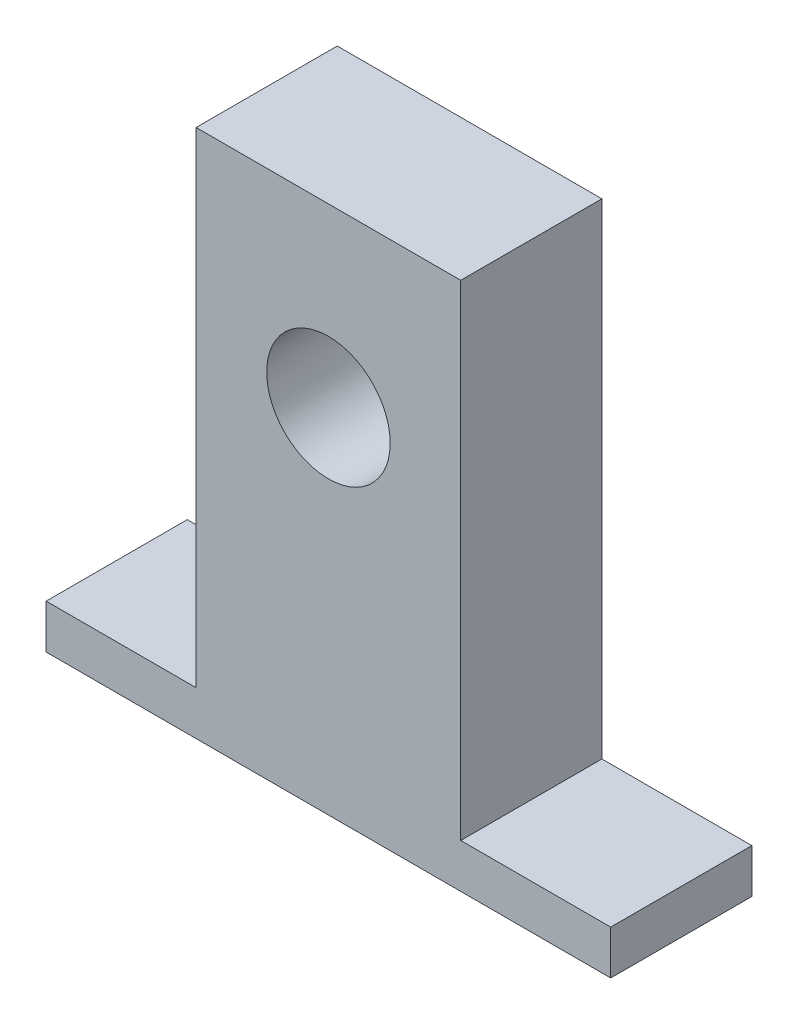
ISO-10303-21;
HEADER;
FILE_DESCRIPTION(('STEP AP214'),'2;1');
FILE_NAME('part.step','',(''),(''),'','','');
FILE_SCHEMA(('AUTOMOTIVE_DESIGN { 1 0 10303 214 1 1 1 1 }'));
ENDSEC;
DATA;
#1=APPLICATION_CONTEXT('core data for automotive mechanical design processes');
#2=APPLICATION_PROTOCOL_DEFINITION('international standard','automotive_design',2000,#1);
#3=PRODUCT_CONTEXT('',#1,'mechanical');
#4=PRODUCT('Part','Part','',(#3));
#5=PRODUCT_RELATED_PRODUCT_CATEGORY('part','',(#4));
#6=PRODUCT_DEFINITION_FORMATION('','',#4);
#7=PRODUCT_DEFINITION_CONTEXT('part definition',#1,'design');
#8=PRODUCT_DEFINITION('design','',#6,#7);
#9=PRODUCT_DEFINITION_SHAPE('','',#8);
#10=(LENGTH_UNIT() NAMED_UNIT(*) SI_UNIT(.MILLI.,.METRE.));
#11=(NAMED_UNIT(*) PLANE_ANGLE_UNIT() SI_UNIT($,.RADIAN.));
#12=(NAMED_UNIT(*) SI_UNIT($,.STERADIAN.) SOLID_ANGLE_UNIT());
#13=UNCERTAINTY_MEASURE_WITH_UNIT(LENGTH_MEASURE(1.E-05),#10,'distance_accuracy_value','');
#14=(GEOMETRIC_REPRESENTATION_CONTEXT(3) GLOBAL_UNCERTAINTY_ASSIGNED_CONTEXT((#13)) GLOBAL_UNIT_ASSIGNED_CONTEXT((#10,
#11,#12)) REPRESENTATION_CONTEXT('',''));
#15=CARTESIAN_POINT('',(0.,0.,0.));
#16=DIRECTION('',(0.,0.,1.));
#17=DIRECTION('',(1.,0.,0.));
#18=AXIS2_PLACEMENT_3D('',#15,#16,#17);
#19=CARTESIAN_POINT('',(0.,5.,0.));
#20=DIRECTION('',(0.,-1.,0.));
#21=DIRECTION('',(0.,0.,-1.));
#22=AXIS2_PLACEMENT_3D('',#19,#20,#21);
#23=PLANE('',#22);
#24=DIRECTION('',(0.,0.,-1.));
#25=VECTOR('',#24,1.);
#26=CARTESIAN_POINT('',(15.,5.,8.));
#27=LINE('',#26,#25);
#28=CARTESIAN_POINT('',(15.,5.,8.));
#29=VERTEX_POINT('',#28);
#30=CARTESIAN_POINT('',(15.,5.,-8.));
#31=VERTEX_POINT('',#30);
#32=EDGE_CURVE('E48',#29,#31,#27,.T.);
#33=ORIENTED_EDGE('',*,*,#32,.F.);
#34=DIRECTION('',(1.,0.,0.));
#35=VECTOR('',#34,1.);
#36=CARTESIAN_POINT('',(-32.,5.,8.));
#37=LINE('',#36,#35);
#38=CARTESIAN_POINT('',(32.,5.,8.));
#39=VERTEX_POINT('',#38);
#40=EDGE_CURVE('E137',#29,#39,#37,.T.);
#41=ORIENTED_EDGE('',*,*,#40,.T.);
#42=DIRECTION('',(0.,0.,-1.));
#43=VECTOR('',#42,1.);
#44=CARTESIAN_POINT('',(32.,5.,8.));
#45=LINE('',#44,#43);
#46=CARTESIAN_POINT('',(32.,5.,-8.));
#47=VERTEX_POINT('',#46);
#48=EDGE_CURVE('E128',#39,#47,#45,.T.);
#49=ORIENTED_EDGE('',*,*,#48,.T.);
#50=DIRECTION('',(-1.,0.,0.));
#51=VECTOR('',#50,1.);
#52=CARTESIAN_POINT('',(-32.,5.,-8.));
#53=LINE('',#52,#51);
#54=EDGE_CURVE('E133',#47,#31,#53,.T.);
#55=ORIENTED_EDGE('',*,*,#54,.T.);
#56=EDGE_LOOP('',(#33,#41,#49,#55));
#57=FACE_BOUND('',#56,.T.);
#58=ADVANCED_FACE('F33',(#57),#23,.F.);
#59=DIRECTION('',(0.,0.,1.));
#60=VECTOR('',#59,1.);
#61=CARTESIAN_POINT('',(-15.,5.,8.));
#62=LINE('',#61,#60);
#63=CARTESIAN_POINT('',(-15.,5.,-8.));
#64=VERTEX_POINT('',#63);
#65=CARTESIAN_POINT('',(-15.,5.,8.));
#66=VERTEX_POINT('',#65);
#67=EDGE_CURVE('E56',#64,#66,#62,.T.);
#68=ORIENTED_EDGE('',*,*,#67,.F.);
#69=CARTESIAN_POINT('',(-32.,5.,-8.));
#70=VERTEX_POINT('',#69);
#71=EDGE_CURVE('E131',#64,#70,#53,.T.);
#72=ORIENTED_EDGE('',*,*,#71,.T.);
#73=DIRECTION('',(0.,0.,1.));
#74=VECTOR('',#73,1.);
#75=CARTESIAN_POINT('',(-32.,5.,8.));
#76=LINE('',#75,#74);
#77=CARTESIAN_POINT('',(-32.,5.,8.));
#78=VERTEX_POINT('',#77);
#79=EDGE_CURVE('E135',#70,#78,#76,.T.);
#80=ORIENTED_EDGE('',*,*,#79,.T.);
#81=EDGE_CURVE('E138',#78,#66,#37,.T.);
#82=ORIENTED_EDGE('',*,*,#81,.T.);
#83=EDGE_LOOP('',(#68,#72,#80,#82));
#84=FACE_BOUND('',#83,.T.);
#85=ADVANCED_FACE('F194',(#84),#23,.F.);
#86=CARTESIAN_POINT('',(32.,5.,8.));
#87=DIRECTION('',(-1.,0.,0.));
#88=DIRECTION('',(0.,0.,1.));
#89=AXIS2_PLACEMENT_3D('',#86,#87,#88);
#90=PLANE('',#89);
#91=DIRECTION('',(0.,0.,-1.));
#92=VECTOR('',#91,1.);
#93=CARTESIAN_POINT('',(32.,0.,8.));
#94=LINE('',#93,#92);
#95=CARTESIAN_POINT('',(32.,0.,8.));
#96=VERTEX_POINT('',#95);
#97=CARTESIAN_POINT('',(32.,0.,-8.));
#98=VERTEX_POINT('',#97);
#99=EDGE_CURVE('E119',#96,#98,#94,.T.);
#100=ORIENTED_EDGE('',*,*,#99,.T.);
#101=DIRECTION('',(0.,-1.,0.));
#102=VECTOR('',#101,1.);
#103=CARTESIAN_POINT('',(32.,5.,-8.));
#104=LINE('',#103,#102);
#105=EDGE_CURVE('E11',#47,#98,#104,.T.);
#106=ORIENTED_EDGE('',*,*,#105,.F.);
#107=ORIENTED_EDGE('',*,*,#48,.F.);
#108=DIRECTION('',(0.,-1.,0.));
#109=VECTOR('',#108,1.);
#110=CARTESIAN_POINT('',(32.,5.,8.));
#111=LINE('',#110,#109);
#112=EDGE_CURVE('E139',#39,#96,#111,.T.);
#113=ORIENTED_EDGE('',*,*,#112,.T.);
#114=EDGE_LOOP('',(#100,#106,#107,#113));
#115=FACE_BOUND('',#114,.T.);
#116=ADVANCED_FACE('F35',(#115),#90,.F.);
#117=CARTESIAN_POINT('',(-32.,5.,-8.));
#118=DIRECTION('',(0.,0.,1.));
#119=DIRECTION('',(1.,0.,0.));
#120=AXIS2_PLACEMENT_3D('',#117,#118,#119);
#121=PLANE('',#120);
#122=CARTESIAN_POINT('',(0.,40.,-8.));
#123=DIRECTION('',(0.,0.,1.));
#124=DIRECTION('',(1.,0.,0.));
#125=AXIS2_PLACEMENT_3D('',#122,#123,#124);
#126=CIRCLE('',#125,7.);
#127=CARTESIAN_POINT('',(6.99999999999997,40.,-8.));
#128=VERTEX_POINT('',#127);
#129=EDGE_CURVE('E173',#128,#128,#126,.T.);
#130=ORIENTED_EDGE('',*,*,#129,.T.);
#131=EDGE_LOOP('',(#130));
#132=FACE_BOUND('',#131,.T.);
#133=DIRECTION('',(-1.,0.,0.));
#134=VECTOR('',#133,1.);
#135=CARTESIAN_POINT('',(-32.,0.,-8.));
#136=LINE('',#135,#134);
#137=CARTESIAN_POINT('',(-32.,0.,-8.));
#138=VERTEX_POINT('',#137);
#139=EDGE_CURVE('E122',#98,#138,#136,.T.);
#140=ORIENTED_EDGE('',*,*,#139,.T.);
#141=DIRECTION('',(0.,-1.,0.));
#142=VECTOR('',#141,1.);
#143=CARTESIAN_POINT('',(-32.,5.,-8.));
#144=LINE('',#143,#142);
#145=EDGE_CURVE('E41',#70,#138,#144,.T.);
#146=ORIENTED_EDGE('',*,*,#145,.F.);
#147=ORIENTED_EDGE('',*,*,#71,.F.);
#148=DIRECTION('',(0.,-1.,0.));
#149=VECTOR('',#148,1.);
#150=CARTESIAN_POINT('',(-15.,60.,-8.));
#151=LINE('',#150,#149);
#152=CARTESIAN_POINT('',(-15.,60.,-8.));
#153=VERTEX_POINT('',#152);
#154=EDGE_CURVE('E104',#153,#64,#151,.T.);
#155=ORIENTED_EDGE('',*,*,#154,.F.);
#156=DIRECTION('',(-1.,0.,0.));
#157=VECTOR('',#156,1.);
#158=CARTESIAN_POINT('',(-15.,60.,-8.));
#159=LINE('',#158,#157);
#160=CARTESIAN_POINT('',(15.,60.,-8.));
#161=VERTEX_POINT('',#160);
#162=EDGE_CURVE('E98',#161,#153,#159,.T.);
#163=ORIENTED_EDGE('',*,*,#162,.F.);
#164=DIRECTION('',(0.,-1.,0.));
#165=VECTOR('',#164,1.);
#166=CARTESIAN_POINT('',(15.,60.,-8.));
#167=LINE('',#166,#165);
#168=EDGE_CURVE('E102',#161,#31,#167,.T.);
#169=ORIENTED_EDGE('',*,*,#168,.T.);
#170=ORIENTED_EDGE('',*,*,#54,.F.);
#171=ORIENTED_EDGE('',*,*,#105,.T.);
#172=EDGE_LOOP('',(#140,#146,#147,#155,#163,#169,#170,#171));
#173=FACE_BOUND('',#172,.T.);
#174=ADVANCED_FACE('F100',(#132,#173),#121,.F.);
#175=CARTESIAN_POINT('',(-32.,5.,8.));
#176=DIRECTION('',(1.,0.,0.));
#177=DIRECTION('',(0.,0.,-1.));
#178=AXIS2_PLACEMENT_3D('',#175,#176,#177);
#179=PLANE('',#178);
#180=DIRECTION('',(0.,0.,1.));
#181=VECTOR('',#180,1.);
#182=CARTESIAN_POINT('',(-32.,0.,8.));
#183=LINE('',#182,#181);
#184=CARTESIAN_POINT('',(-32.,0.,8.));
#185=VERTEX_POINT('',#184);
#186=EDGE_CURVE('E142',#138,#185,#183,.T.);
#187=ORIENTED_EDGE('',*,*,#186,.T.);
#188=DIRECTION('',(0.,-1.,0.));
#189=VECTOR('',#188,1.);
#190=CARTESIAN_POINT('',(-32.,5.,8.));
#191=LINE('',#190,#189);
#192=EDGE_CURVE('E147',#78,#185,#191,.T.);
#193=ORIENTED_EDGE('',*,*,#192,.F.);
#194=ORIENTED_EDGE('',*,*,#79,.F.);
#195=ORIENTED_EDGE('',*,*,#145,.T.);
#196=EDGE_LOOP('',(#187,#193,#194,#195));
#197=FACE_BOUND('',#196,.T.);
#198=ADVANCED_FACE('F154',(#197),#179,.F.);
#199=CARTESIAN_POINT('',(-32.,5.,8.));
#200=DIRECTION('',(0.,0.,-1.));
#201=DIRECTION('',(-1.,0.,0.));
#202=AXIS2_PLACEMENT_3D('',#199,#200,#201);
#203=PLANE('',#202);
#204=CARTESIAN_POINT('',(0.,40.,8.));
#205=DIRECTION('',(0.,0.,1.));
#206=DIRECTION('',(1.,0.,0.));
#207=AXIS2_PLACEMENT_3D('',#204,#205,#206);
#208=CIRCLE('',#207,7.);
#209=CARTESIAN_POINT('',(6.99999999999997,40.,8.));
#210=VERTEX_POINT('',#209);
#211=EDGE_CURVE('E178',#210,#210,#208,.T.);
#212=ORIENTED_EDGE('',*,*,#211,.F.);
#213=EDGE_LOOP('',(#212));
#214=FACE_BOUND('',#213,.T.);
#215=DIRECTION('',(1.,0.,0.));
#216=VECTOR('',#215,1.);
#217=CARTESIAN_POINT('',(-32.,0.,8.));
#218=LINE('',#217,#216);
#219=EDGE_CURVE('E132',#185,#96,#218,.T.);
#220=ORIENTED_EDGE('',*,*,#219,.T.);
#221=ORIENTED_EDGE('',*,*,#112,.F.);
#222=ORIENTED_EDGE('',*,*,#40,.F.);
#223=DIRECTION('',(0.,-1.,0.));
#224=VECTOR('',#223,1.);
#225=CARTESIAN_POINT('',(15.,60.,8.));
#226=LINE('',#225,#224);
#227=CARTESIAN_POINT('',(15.,60.,8.));
#228=VERTEX_POINT('',#227);
#229=EDGE_CURVE('E167',#228,#29,#226,.T.);
#230=ORIENTED_EDGE('',*,*,#229,.F.);
#231=DIRECTION('',(1.,0.,0.));
#232=VECTOR('',#231,1.);
#233=CARTESIAN_POINT('',(-15.,60.,8.));
#234=LINE('',#233,#232);
#235=CARTESIAN_POINT('',(-15.,60.,8.));
#236=VERTEX_POINT('',#235);
#237=EDGE_CURVE('E113',#236,#228,#234,.T.);
#238=ORIENTED_EDGE('',*,*,#237,.F.);
#239=DIRECTION('',(0.,-1.,0.));
#240=VECTOR('',#239,1.);
#241=CARTESIAN_POINT('',(-15.,60.,8.));
#242=LINE('',#241,#240);
#243=EDGE_CURVE('E124',#236,#66,#242,.T.);
#244=ORIENTED_EDGE('',*,*,#243,.T.);
#245=ORIENTED_EDGE('',*,*,#81,.F.);
#246=ORIENTED_EDGE('',*,*,#192,.T.);
#247=EDGE_LOOP('',(#220,#221,#222,#230,#238,#244,#245,#246));
#248=FACE_BOUND('',#247,.T.);
#249=ADVANCED_FACE('F162',(#214,#248),#203,.F.);
#250=CARTESIAN_POINT('',(0.,0.,0.));
#251=DIRECTION('',(0.,-1.,0.));
#252=DIRECTION('',(0.,0.,-1.));
#253=AXIS2_PLACEMENT_3D('',#250,#251,#252);
#254=PLANE('',#253);
#255=ORIENTED_EDGE('',*,*,#99,.F.);
#256=ORIENTED_EDGE('',*,*,#219,.F.);
#257=ORIENTED_EDGE('',*,*,#186,.F.);
#258=ORIENTED_EDGE('',*,*,#139,.F.);
#259=EDGE_LOOP('',(#255,#256,#257,#258));
#260=FACE_BOUND('',#259,.T.);
#261=ADVANCED_FACE('F159',(#260),#254,.T.);
#262=CARTESIAN_POINT('',(15.,60.,8.));
#263=DIRECTION('',(-1.,0.,0.));
#264=DIRECTION('',(0.,0.,1.));
#265=AXIS2_PLACEMENT_3D('',#262,#263,#264);
#266=PLANE('',#265);
#267=ORIENTED_EDGE('',*,*,#32,.T.);
#268=ORIENTED_EDGE('',*,*,#168,.F.);
#269=DIRECTION('',(0.,0.,-1.));
#270=VECTOR('',#269,1.);
#271=CARTESIAN_POINT('',(15.,60.,8.));
#272=LINE('',#271,#270);
#273=EDGE_CURVE('E108',#228,#161,#272,.T.);
#274=ORIENTED_EDGE('',*,*,#273,.F.);
#275=ORIENTED_EDGE('',*,*,#229,.T.);
#276=EDGE_LOOP('',(#267,#268,#274,#275));
#277=FACE_BOUND('',#276,.T.);
#278=ADVANCED_FACE('F118',(#277),#266,.F.);
#279=CARTESIAN_POINT('',(-15.,60.,8.));
#280=DIRECTION('',(1.,0.,0.));
#281=DIRECTION('',(0.,0.,-1.));
#282=AXIS2_PLACEMENT_3D('',#279,#280,#281);
#283=PLANE('',#282);
#284=ORIENTED_EDGE('',*,*,#67,.T.);
#285=ORIENTED_EDGE('',*,*,#243,.F.);
#286=DIRECTION('',(0.,0.,1.));
#287=VECTOR('',#286,1.);
#288=CARTESIAN_POINT('',(-15.,60.,8.));
#289=LINE('',#288,#287);
#290=EDGE_CURVE('E107',#153,#236,#289,.T.);
#291=ORIENTED_EDGE('',*,*,#290,.F.);
#292=ORIENTED_EDGE('',*,*,#154,.T.);
#293=EDGE_LOOP('',(#284,#285,#291,#292));
#294=FACE_BOUND('',#293,.T.);
#295=ADVANCED_FACE('F202',(#294),#283,.F.);
#296=CARTESIAN_POINT('',(0.,60.,0.));
#297=DIRECTION('',(0.,-1.,0.));
#298=DIRECTION('',(0.,0.,-1.));
#299=AXIS2_PLACEMENT_3D('',#296,#297,#298);
#300=PLANE('',#299);
#301=ORIENTED_EDGE('',*,*,#273,.T.);
#302=ORIENTED_EDGE('',*,*,#162,.T.);
#303=ORIENTED_EDGE('',*,*,#290,.T.);
#304=ORIENTED_EDGE('',*,*,#237,.T.);
#305=EDGE_LOOP('',(#301,#302,#303,#304));
#306=FACE_BOUND('',#305,.T.);
#307=ADVANCED_FACE('F111',(#306),#300,.F.);
#308=CARTESIAN_POINT('',(0.,40.,-47.));
#309=DIRECTION('',(0.,0.,1.));
#310=DIRECTION('',(1.,0.,0.));
#311=AXIS2_PLACEMENT_3D('',#308,#309,#310);
#312=CYLINDRICAL_SURFACE('',#311,7.);
#313=ORIENTED_EDGE('',*,*,#211,.T.);
#314=EDGE_LOOP('',(#313));
#315=FACE_BOUND('',#314,.T.);
#316=ORIENTED_EDGE('',*,*,#129,.F.);
#317=EDGE_LOOP('',(#316));
#318=FACE_BOUND('',#317,.T.);
#319=ADVANCED_FACE('F182',(#315,#318),#312,.F.);
#320=CLOSED_SHELL('',(#58,#85,#116,#174,#198,#249,#261,#278,#295,#307,#319));
#321=MANIFOLD_SOLID_BREP('B2',#320);
#322=ADVANCED_BREP_SHAPE_REPRESENTATION('',(#18,#321),#14);
#323=SHAPE_DEFINITION_REPRESENTATION(#9,#322);
ENDSEC;
END-ISO-10303-21;
